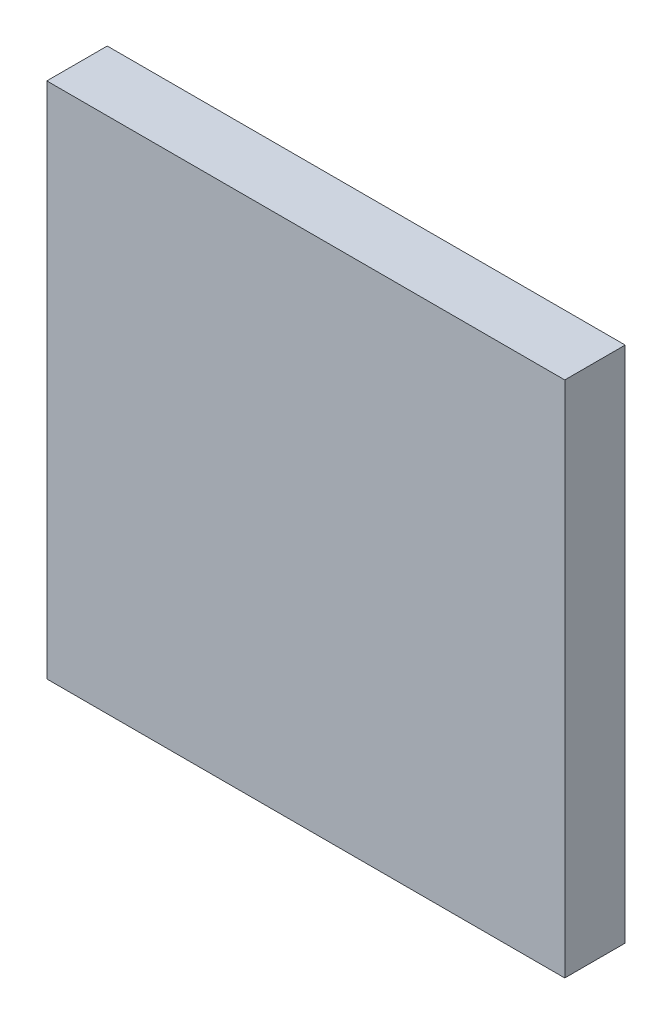
ISO-10303-21;
HEADER;
FILE_DESCRIPTION(('STEP AP214'),'2;1');
FILE_NAME('part.step','',(''),(''),'','','');
FILE_SCHEMA(('AUTOMOTIVE_DESIGN { 1 0 10303 214 1 1 1 1 }'));
ENDSEC;
DATA;
#1=APPLICATION_CONTEXT('core data for automotive mechanical design processes');
#2=APPLICATION_PROTOCOL_DEFINITION('international standard','automotive_design',2000,#1);
#3=PRODUCT_CONTEXT('',#1,'mechanical');
#4=PRODUCT('Part','Part','',(#3));
#5=PRODUCT_RELATED_PRODUCT_CATEGORY('part','',(#4));
#6=PRODUCT_DEFINITION_FORMATION('','',#4);
#7=PRODUCT_DEFINITION_CONTEXT('part definition',#1,'design');
#8=PRODUCT_DEFINITION('design','',#6,#7);
#9=PRODUCT_DEFINITION_SHAPE('','',#8);
#10=(LENGTH_UNIT() NAMED_UNIT(*) SI_UNIT(.MILLI.,.METRE.));
#11=(NAMED_UNIT(*) PLANE_ANGLE_UNIT() SI_UNIT($,.RADIAN.));
#12=(NAMED_UNIT(*) SI_UNIT($,.STERADIAN.) SOLID_ANGLE_UNIT());
#13=UNCERTAINTY_MEASURE_WITH_UNIT(LENGTH_MEASURE(1.E-05),#10,'distance_accuracy_value','');
#14=(GEOMETRIC_REPRESENTATION_CONTEXT(3) GLOBAL_UNCERTAINTY_ASSIGNED_CONTEXT((#13)) GLOBAL_UNIT_ASSIGNED_CONTEXT((#10,
#11,#12)) REPRESENTATION_CONTEXT('',''));
#15=CARTESIAN_POINT('',(0.,0.,0.));
#16=DIRECTION('',(0.,0.,1.));
#17=DIRECTION('',(1.,0.,0.));
#18=AXIS2_PLACEMENT_3D('',#15,#16,#17);
#19=CARTESIAN_POINT('',(-5.99999999999999,-6.00000000000001,1.4));
#20=DIRECTION('',(1.,0.,0.));
#21=DIRECTION('',(0.,0.,-1.));
#22=AXIS2_PLACEMENT_3D('',#19,#20,#21);
#23=PLANE('',#22);
#24=DIRECTION('',(0.,-1.,0.));
#25=VECTOR('',#24,1.);
#26=CARTESIAN_POINT('',(-5.99999999999999,-6.00000000000001,0.));
#27=LINE('',#26,#25);
#28=CARTESIAN_POINT('',(-5.99999999999999,5.99999999999999,0.));
#29=VERTEX_POINT('',#28);
#30=CARTESIAN_POINT('',(-5.99999999999999,-6.00000000000001,0.));
#31=VERTEX_POINT('',#30);
#32=EDGE_CURVE('E100',#29,#31,#27,.T.);
#33=ORIENTED_EDGE('',*,*,#32,.T.);
#34=DIRECTION('',(0.,0.,-1.));
#35=VECTOR('',#34,1.);
#36=CARTESIAN_POINT('',(-5.99999999999999,-6.00000000000001,1.4));
#37=LINE('',#36,#35);
#38=CARTESIAN_POINT('',(-5.99999999999999,-6.00000000000001,1.4));
#39=VERTEX_POINT('',#38);
#40=EDGE_CURVE('E11',#39,#31,#37,.T.);
#41=ORIENTED_EDGE('',*,*,#40,.F.);
#42=DIRECTION('',(0.,-1.,0.));
#43=VECTOR('',#42,1.);
#44=CARTESIAN_POINT('',(-5.99999999999999,-6.00000000000001,1.4));
#45=LINE('',#44,#43);
#46=CARTESIAN_POINT('',(-5.99999999999999,5.99999999999999,1.4));
#47=VERTEX_POINT('',#46);
#48=EDGE_CURVE('E88',#47,#39,#45,.T.);
#49=ORIENTED_EDGE('',*,*,#48,.F.);
#50=DIRECTION('',(0.,0.,-1.));
#51=VECTOR('',#50,1.);
#52=CARTESIAN_POINT('',(-5.99999999999999,5.99999999999999,1.4));
#53=LINE('',#52,#51);
#54=EDGE_CURVE('E96',#47,#29,#53,.T.);
#55=ORIENTED_EDGE('',*,*,#54,.T.);
#56=EDGE_LOOP('',(#33,#41,#49,#55));
#57=FACE_BOUND('',#56,.T.);
#58=ADVANCED_FACE('F37',(#57),#23,.F.);
#59=CARTESIAN_POINT('',(6.00000000000001,-6.00000000000001,1.4));
#60=DIRECTION('',(0.,1.,0.));
#61=DIRECTION('',(-1.,0.,0.));
#62=AXIS2_PLACEMENT_3D('',#59,#60,#61);
#63=PLANE('',#62);
#64=DIRECTION('',(1.,0.,0.));
#65=VECTOR('',#64,1.);
#66=CARTESIAN_POINT('',(6.00000000000001,-6.00000000000001,0.));
#67=LINE('',#66,#65);
#68=CARTESIAN_POINT('',(6.00000000000001,-6.00000000000001,0.));
#69=VERTEX_POINT('',#68);
#70=EDGE_CURVE('E92',#31,#69,#67,.T.);
#71=ORIENTED_EDGE('',*,*,#70,.T.);
#72=DIRECTION('',(0.,0.,-1.));
#73=VECTOR('',#72,1.);
#74=CARTESIAN_POINT('',(6.00000000000001,-6.00000000000001,1.4));
#75=LINE('',#74,#73);
#76=CARTESIAN_POINT('',(6.00000000000001,-6.00000000000001,1.4));
#77=VERTEX_POINT('',#76);
#78=EDGE_CURVE('E45',#77,#69,#75,.T.);
#79=ORIENTED_EDGE('',*,*,#78,.F.);
#80=DIRECTION('',(1.,0.,0.));
#81=VECTOR('',#80,1.);
#82=CARTESIAN_POINT('',(6.00000000000001,-6.00000000000001,1.4));
#83=LINE('',#82,#81);
#84=EDGE_CURVE('E83',#39,#77,#83,.T.);
#85=ORIENTED_EDGE('',*,*,#84,.F.);
#86=ORIENTED_EDGE('',*,*,#40,.T.);
#87=EDGE_LOOP('',(#71,#79,#85,#86));
#88=FACE_BOUND('',#87,.T.);
#89=ADVANCED_FACE('F91',(#88),#63,.F.);
#90=CARTESIAN_POINT('',(6.00000000000001,-6.00000000000001,1.4));
#91=DIRECTION('',(-1.,0.,0.));
#92=DIRECTION('',(0.,0.,1.));
#93=AXIS2_PLACEMENT_3D('',#90,#91,#92);
#94=PLANE('',#93);
#95=DIRECTION('',(0.,1.,0.));
#96=VECTOR('',#95,1.);
#97=CARTESIAN_POINT('',(6.00000000000001,-6.00000000000001,0.));
#98=LINE('',#97,#96);
#99=CARTESIAN_POINT('',(6.00000000000001,5.99999999999999,0.));
#100=VERTEX_POINT('',#99);
#101=EDGE_CURVE('E70',#69,#100,#98,.T.);
#102=ORIENTED_EDGE('',*,*,#101,.T.);
#103=DIRECTION('',(0.,0.,-1.));
#104=VECTOR('',#103,1.);
#105=CARTESIAN_POINT('',(6.00000000000001,5.99999999999999,1.4));
#106=LINE('',#105,#104);
#107=CARTESIAN_POINT('',(6.00000000000001,5.99999999999999,1.4));
#108=VERTEX_POINT('',#107);
#109=EDGE_CURVE('E93',#108,#100,#106,.T.);
#110=ORIENTED_EDGE('',*,*,#109,.F.);
#111=DIRECTION('',(0.,1.,0.));
#112=VECTOR('',#111,1.);
#113=CARTESIAN_POINT('',(6.00000000000001,-6.00000000000001,1.4));
#114=LINE('',#113,#112);
#115=EDGE_CURVE('E86',#77,#108,#114,.T.);
#116=ORIENTED_EDGE('',*,*,#115,.F.);
#117=ORIENTED_EDGE('',*,*,#78,.T.);
#118=EDGE_LOOP('',(#102,#110,#116,#117));
#119=FACE_BOUND('',#118,.T.);
#120=ADVANCED_FACE('F94',(#119),#94,.F.);
#121=CARTESIAN_POINT('',(6.00000000000001,5.99999999999999,1.4));
#122=DIRECTION('',(0.,-1.,0.));
#123=DIRECTION('',(0.,0.,-1.));
#124=AXIS2_PLACEMENT_3D('',#121,#122,#123);
#125=PLANE('',#124);
#126=DIRECTION('',(-1.,0.,0.));
#127=VECTOR('',#126,1.);
#128=CARTESIAN_POINT('',(6.00000000000001,5.99999999999999,0.));
#129=LINE('',#128,#127);
#130=EDGE_CURVE('E76',#100,#29,#129,.T.);
#131=ORIENTED_EDGE('',*,*,#130,.T.);
#132=ORIENTED_EDGE('',*,*,#54,.F.);
#133=DIRECTION('',(-1.,0.,0.));
#134=VECTOR('',#133,1.);
#135=CARTESIAN_POINT('',(6.00000000000001,5.99999999999999,1.4));
#136=LINE('',#135,#134);
#137=EDGE_CURVE('E53',#108,#47,#136,.T.);
#138=ORIENTED_EDGE('',*,*,#137,.F.);
#139=ORIENTED_EDGE('',*,*,#109,.T.);
#140=EDGE_LOOP('',(#131,#132,#138,#139));
#141=FACE_BOUND('',#140,.T.);
#142=ADVANCED_FACE('F107',(#141),#125,.F.);
#143=CARTESIAN_POINT('',(-5.99999999999999,5.99999999999999,1.4));
#144=DIRECTION('',(0.,0.,1.));
#145=DIRECTION('',(1.,0.,0.));
#146=AXIS2_PLACEMENT_3D('',#143,#144,#145);
#147=PLANE('',#146);
#148=ORIENTED_EDGE('',*,*,#48,.T.);
#149=ORIENTED_EDGE('',*,*,#84,.T.);
#150=ORIENTED_EDGE('',*,*,#115,.T.);
#151=ORIENTED_EDGE('',*,*,#137,.T.);
#152=EDGE_LOOP('',(#148,#149,#150,#151));
#153=FACE_BOUND('',#152,.T.);
#154=ADVANCED_FACE('F84',(#153),#147,.T.);
#155=CARTESIAN_POINT('',(-5.99999999999999,5.99999999999999,0.));
#156=DIRECTION('',(0.,0.,1.));
#157=DIRECTION('',(1.,0.,0.));
#158=AXIS2_PLACEMENT_3D('',#155,#156,#157);
#159=PLANE('',#158);
#160=ORIENTED_EDGE('',*,*,#32,.F.);
#161=ORIENTED_EDGE('',*,*,#130,.F.);
#162=ORIENTED_EDGE('',*,*,#101,.F.);
#163=ORIENTED_EDGE('',*,*,#70,.F.);
#164=EDGE_LOOP('',(#160,#161,#162,#163));
#165=FACE_BOUND('',#164,.T.);
#166=ADVANCED_FACE('F110',(#165),#159,.F.);
#167=CLOSED_SHELL('',(#58,#89,#120,#142,#154,#166));
#168=MANIFOLD_SOLID_BREP('B2',#167);
#169=ADVANCED_BREP_SHAPE_REPRESENTATION('',(#18,#168),#14);
#170=SHAPE_DEFINITION_REPRESENTATION(#9,#169);
ENDSEC;
END-ISO-10303-21;
